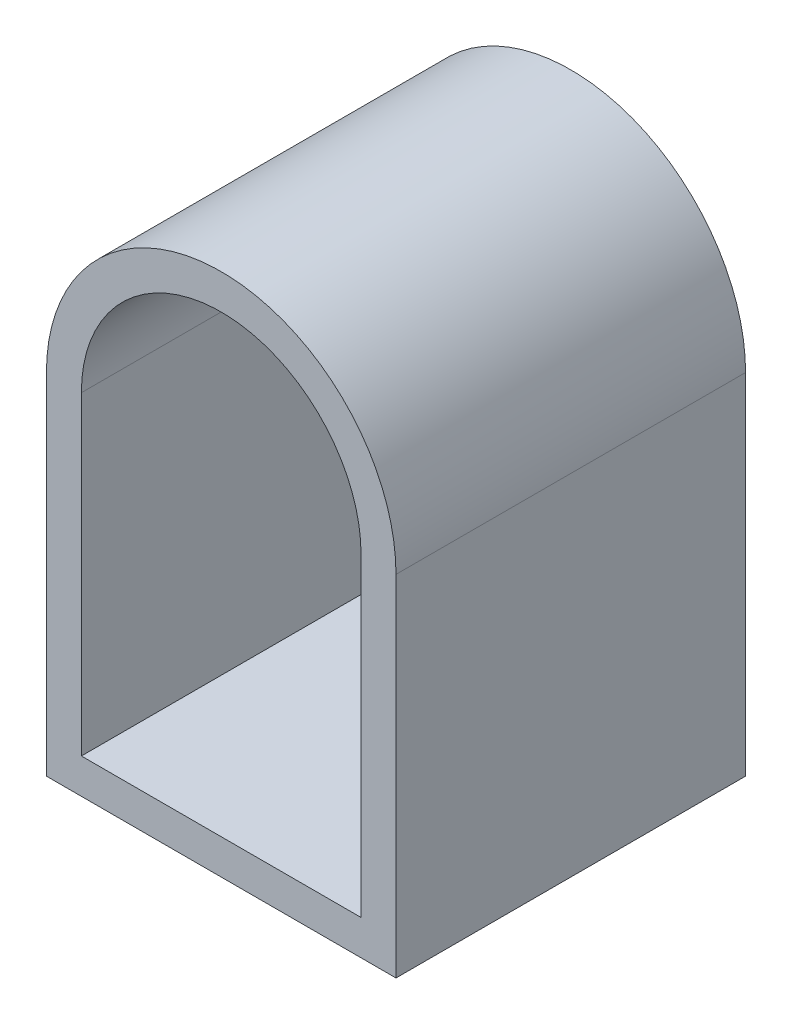
ISO-10303-21;
HEADER;
FILE_DESCRIPTION(('STEP AP214'),'2;1');
FILE_NAME('part.step','',(''),(''),'','','');
FILE_SCHEMA(('AUTOMOTIVE_DESIGN { 1 0 10303 214 1 1 1 1 }'));
ENDSEC;
DATA;
#1=APPLICATION_CONTEXT('core data for automotive mechanical design processes');
#2=APPLICATION_PROTOCOL_DEFINITION('international standard','automotive_design',2000,#1);
#3=PRODUCT_CONTEXT('',#1,'mechanical');
#4=PRODUCT('Part','Part','',(#3));
#5=PRODUCT_RELATED_PRODUCT_CATEGORY('part','',(#4));
#6=PRODUCT_DEFINITION_FORMATION('','',#4);
#7=PRODUCT_DEFINITION_CONTEXT('part definition',#1,'design');
#8=PRODUCT_DEFINITION('design','',#6,#7);
#9=PRODUCT_DEFINITION_SHAPE('','',#8);
#10=(LENGTH_UNIT() NAMED_UNIT(*) SI_UNIT(.MILLI.,.METRE.));
#11=(NAMED_UNIT(*) PLANE_ANGLE_UNIT() SI_UNIT($,.RADIAN.));
#12=(NAMED_UNIT(*) SI_UNIT($,.STERADIAN.) SOLID_ANGLE_UNIT());
#13=UNCERTAINTY_MEASURE_WITH_UNIT(LENGTH_MEASURE(1.E-05),#10,'distance_accuracy_value','');
#14=(GEOMETRIC_REPRESENTATION_CONTEXT(3) GLOBAL_UNCERTAINTY_ASSIGNED_CONTEXT((#13)) GLOBAL_UNIT_ASSIGNED_CONTEXT((#10,
#11,#12)) REPRESENTATION_CONTEXT('',''));
#15=CARTESIAN_POINT('',(0.,0.,0.));
#16=DIRECTION('',(0.,0.,1.));
#17=DIRECTION('',(1.,0.,0.));
#18=AXIS2_PLACEMENT_3D('',#15,#16,#17);
#19=CARTESIAN_POINT('',(6.35,12.7,12.7));
#20=DIRECTION('',(0.,0.,-1.));
#21=DIRECTION('',(-1.,0.,0.));
#22=AXIS2_PLACEMENT_3D('',#19,#20,#21);
#23=PLANE('',#22);
#24=DIRECTION('',(1.,0.,0.));
#25=VECTOR('',#24,1.);
#26=CARTESIAN_POINT('',(12.7,0.,12.7));
#27=LINE('',#26,#25);
#28=CARTESIAN_POINT('',(0.,0.,12.7));
#29=VERTEX_POINT('',#28);
#30=CARTESIAN_POINT('',(12.7,0.,12.7));
#31=VERTEX_POINT('',#30);
#32=EDGE_CURVE('E153',#29,#31,#27,.T.);
#33=ORIENTED_EDGE('',*,*,#32,.T.);
#34=DIRECTION('',(0.,1.,0.));
#35=VECTOR('',#34,1.);
#36=CARTESIAN_POINT('',(12.7,12.7,12.7));
#37=LINE('',#36,#35);
#38=CARTESIAN_POINT('',(12.7,12.7,12.7));
#39=VERTEX_POINT('',#38);
#40=EDGE_CURVE('E157',#31,#39,#37,.T.);
#41=ORIENTED_EDGE('',*,*,#40,.T.);
#42=CARTESIAN_POINT('',(6.35,12.7,12.7));
#43=DIRECTION('',(0.,0.,1.));
#44=DIRECTION('',(-1.,0.,0.));
#45=AXIS2_PLACEMENT_3D('',#42,#43,#44);
#46=CIRCLE('',#45,6.35);
#47=CARTESIAN_POINT('',(0.,12.7,12.7));
#48=VERTEX_POINT('',#47);
#49=EDGE_CURVE('E161',#39,#48,#46,.T.);
#50=ORIENTED_EDGE('',*,*,#49,.T.);
#51=DIRECTION('',(0.,-1.,0.));
#52=VECTOR('',#51,1.);
#53=CARTESIAN_POINT('',(0.,0.,12.7));
#54=LINE('',#53,#52);
#55=EDGE_CURVE('E164',#48,#29,#54,.T.);
#56=ORIENTED_EDGE('',*,*,#55,.T.);
#57=EDGE_LOOP('',(#33,#41,#50,#56));
#58=FACE_BOUND('',#57,.T.);
#59=DIRECTION('',(0.,-1.,0.));
#60=VECTOR('',#59,1.);
#61=CARTESIAN_POINT('',(1.27,12.7,12.7));
#62=LINE('',#61,#60);
#63=CARTESIAN_POINT('',(1.27,12.7,12.7));
#64=VERTEX_POINT('',#63);
#65=CARTESIAN_POINT('',(1.27,1.27,12.7));
#66=VERTEX_POINT('',#65);
#67=EDGE_CURVE('E105',#64,#66,#62,.T.);
#68=ORIENTED_EDGE('',*,*,#67,.F.);
#69=CARTESIAN_POINT('',(6.35,12.7,12.7));
#70=DIRECTION('',(0.,0.,1.));
#71=DIRECTION('',(1.,0.,0.));
#72=AXIS2_PLACEMENT_3D('',#69,#70,#71);
#73=CIRCLE('',#72,5.08);
#74=CARTESIAN_POINT('',(11.43,12.7,12.7));
#75=VERTEX_POINT('',#74);
#76=EDGE_CURVE('E131',#75,#64,#73,.T.);
#77=ORIENTED_EDGE('',*,*,#76,.F.);
#78=DIRECTION('',(0.,1.,0.));
#79=VECTOR('',#78,1.);
#80=CARTESIAN_POINT('',(11.43,1.27,12.7));
#81=LINE('',#80,#79);
#82=CARTESIAN_POINT('',(11.43,1.27,12.7));
#83=VERTEX_POINT('',#82);
#84=EDGE_CURVE('E127',#83,#75,#81,.T.);
#85=ORIENTED_EDGE('',*,*,#84,.F.);
#86=DIRECTION('',(1.,0.,0.));
#87=VECTOR('',#86,1.);
#88=CARTESIAN_POINT('',(1.27,1.27,12.7));
#89=LINE('',#88,#87);
#90=EDGE_CURVE('E114',#66,#83,#89,.T.);
#91=ORIENTED_EDGE('',*,*,#90,.F.);
#92=EDGE_LOOP('',(#68,#77,#85,#91));
#93=FACE_BOUND('',#92,.T.);
#94=ADVANCED_FACE('F39',(#58,#93),#23,.F.);
#95=CARTESIAN_POINT('',(6.35,12.7,0.));
#96=DIRECTION('',(0.,0.,-1.));
#97=DIRECTION('',(-1.,0.,0.));
#98=AXIS2_PLACEMENT_3D('',#95,#96,#97);
#99=PLANE('',#98);
#100=DIRECTION('',(1.,0.,0.));
#101=VECTOR('',#100,1.);
#102=CARTESIAN_POINT('',(12.7,0.,0.));
#103=LINE('',#102,#101);
#104=CARTESIAN_POINT('',(0.,0.,0.));
#105=VERTEX_POINT('',#104);
#106=CARTESIAN_POINT('',(12.7,0.,0.));
#107=VERTEX_POINT('',#106);
#108=EDGE_CURVE('E123',#105,#107,#103,.T.);
#109=ORIENTED_EDGE('',*,*,#108,.F.);
#110=DIRECTION('',(0.,-1.,0.));
#111=VECTOR('',#110,1.);
#112=CARTESIAN_POINT('',(0.,0.,0.));
#113=LINE('',#112,#111);
#114=CARTESIAN_POINT('',(0.,12.7,0.));
#115=VERTEX_POINT('',#114);
#116=EDGE_CURVE('E158',#115,#105,#113,.T.);
#117=ORIENTED_EDGE('',*,*,#116,.F.);
#118=CARTESIAN_POINT('',(6.35,12.7,0.));
#119=DIRECTION('',(0.,0.,1.));
#120=DIRECTION('',(-1.,0.,0.));
#121=AXIS2_PLACEMENT_3D('',#118,#119,#120);
#122=CIRCLE('',#121,6.35);
#123=CARTESIAN_POINT('',(12.7,12.7,0.));
#124=VERTEX_POINT('',#123);
#125=EDGE_CURVE('E174',#124,#115,#122,.T.);
#126=ORIENTED_EDGE('',*,*,#125,.F.);
#127=DIRECTION('',(0.,1.,0.));
#128=VECTOR('',#127,1.);
#129=CARTESIAN_POINT('',(12.7,12.7,0.));
#130=LINE('',#129,#128);
#131=EDGE_CURVE('E171',#107,#124,#130,.T.);
#132=ORIENTED_EDGE('',*,*,#131,.F.);
#133=EDGE_LOOP('',(#109,#117,#126,#132));
#134=FACE_BOUND('',#133,.T.);
#135=CARTESIAN_POINT('',(6.35,12.7,0.));
#136=DIRECTION('',(0.,0.,1.));
#137=DIRECTION('',(1.,0.,0.));
#138=AXIS2_PLACEMENT_3D('',#135,#136,#137);
#139=CIRCLE('',#138,5.08);
#140=CARTESIAN_POINT('',(11.43,12.7,0.));
#141=VERTEX_POINT('',#140);
#142=CARTESIAN_POINT('',(1.27,12.7,0.));
#143=VERTEX_POINT('',#142);
#144=EDGE_CURVE('E115',#141,#143,#139,.T.);
#145=ORIENTED_EDGE('',*,*,#144,.T.);
#146=DIRECTION('',(0.,-1.,0.));
#147=VECTOR('',#146,1.);
#148=CARTESIAN_POINT('',(1.27,12.7,0.));
#149=LINE('',#148,#147);
#150=CARTESIAN_POINT('',(1.27,1.27,0.));
#151=VERTEX_POINT('',#150);
#152=EDGE_CURVE('E63',#143,#151,#149,.T.);
#153=ORIENTED_EDGE('',*,*,#152,.T.);
#154=DIRECTION('',(1.,0.,0.));
#155=VECTOR('',#154,1.);
#156=CARTESIAN_POINT('',(1.27,1.27,0.));
#157=LINE('',#156,#155);
#158=CARTESIAN_POINT('',(11.43,1.27,0.));
#159=VERTEX_POINT('',#158);
#160=EDGE_CURVE('E121',#151,#159,#157,.T.);
#161=ORIENTED_EDGE('',*,*,#160,.T.);
#162=DIRECTION('',(0.,1.,0.));
#163=VECTOR('',#162,1.);
#164=CARTESIAN_POINT('',(11.43,1.27,0.));
#165=LINE('',#164,#163);
#166=EDGE_CURVE('E140',#159,#141,#165,.T.);
#167=ORIENTED_EDGE('',*,*,#166,.T.);
#168=EDGE_LOOP('',(#145,#153,#161,#167));
#169=FACE_BOUND('',#168,.T.);
#170=ADVANCED_FACE('F197',(#134,#169),#99,.T.);
#171=CARTESIAN_POINT('',(12.7,0.,12.7));
#172=DIRECTION('',(0.,1.,0.));
#173=DIRECTION('',(-1.,0.,0.));
#174=AXIS2_PLACEMENT_3D('',#171,#172,#173);
#175=PLANE('',#174);
#176=ORIENTED_EDGE('',*,*,#108,.T.);
#177=DIRECTION('',(0.,0.,-1.));
#178=VECTOR('',#177,1.);
#179=CARTESIAN_POINT('',(12.7,0.,12.7));
#180=LINE('',#179,#178);
#181=EDGE_CURVE('E11',#31,#107,#180,.T.);
#182=ORIENTED_EDGE('',*,*,#181,.F.);
#183=ORIENTED_EDGE('',*,*,#32,.F.);
#184=DIRECTION('',(0.,0.,-1.));
#185=VECTOR('',#184,1.);
#186=CARTESIAN_POINT('',(0.,0.,12.7));
#187=LINE('',#186,#185);
#188=EDGE_CURVE('E167',#29,#105,#187,.T.);
#189=ORIENTED_EDGE('',*,*,#188,.T.);
#190=EDGE_LOOP('',(#176,#182,#183,#189));
#191=FACE_BOUND('',#190,.T.);
#192=ADVANCED_FACE('F41',(#191),#175,.F.);
#193=CARTESIAN_POINT('',(12.7,12.7,12.7));
#194=DIRECTION('',(-1.,0.,0.));
#195=DIRECTION('',(0.,-1.,0.));
#196=AXIS2_PLACEMENT_3D('',#193,#194,#195);
#197=PLANE('',#196);
#198=ORIENTED_EDGE('',*,*,#131,.T.);
#199=DIRECTION('',(0.,0.,-1.));
#200=VECTOR('',#199,1.);
#201=CARTESIAN_POINT('',(12.7,12.7,12.7));
#202=LINE('',#201,#200);
#203=EDGE_CURVE('E48',#39,#124,#202,.T.);
#204=ORIENTED_EDGE('',*,*,#203,.F.);
#205=ORIENTED_EDGE('',*,*,#40,.F.);
#206=ORIENTED_EDGE('',*,*,#181,.T.);
#207=EDGE_LOOP('',(#198,#204,#205,#206));
#208=FACE_BOUND('',#207,.T.);
#209=ADVANCED_FACE('F207',(#208),#197,.F.);
#210=CARTESIAN_POINT('',(6.35,12.7,12.7));
#211=DIRECTION('',(0.,0.,-1.));
#212=DIRECTION('',(-1.,0.,0.));
#213=AXIS2_PLACEMENT_3D('',#210,#211,#212);
#214=CYLINDRICAL_SURFACE('',#213,6.35);
#215=ORIENTED_EDGE('',*,*,#125,.T.);
#216=DIRECTION('',(0.,0.,-1.));
#217=VECTOR('',#216,1.);
#218=CARTESIAN_POINT('',(0.,12.7,12.7));
#219=LINE('',#218,#217);
#220=EDGE_CURVE('E182',#48,#115,#219,.T.);
#221=ORIENTED_EDGE('',*,*,#220,.F.);
#222=ORIENTED_EDGE('',*,*,#49,.F.);
#223=ORIENTED_EDGE('',*,*,#203,.T.);
#224=EDGE_LOOP('',(#215,#221,#222,#223));
#225=FACE_BOUND('',#224,.T.);
#226=ADVANCED_FACE('F191',(#225),#214,.T.);
#227=CARTESIAN_POINT('',(0.,0.,12.7));
#228=DIRECTION('',(1.,0.,0.));
#229=DIRECTION('',(0.,0.,-1.));
#230=AXIS2_PLACEMENT_3D('',#227,#228,#229);
#231=PLANE('',#230);
#232=ORIENTED_EDGE('',*,*,#116,.T.);
#233=ORIENTED_EDGE('',*,*,#188,.F.);
#234=ORIENTED_EDGE('',*,*,#55,.F.);
#235=ORIENTED_EDGE('',*,*,#220,.T.);
#236=EDGE_LOOP('',(#232,#233,#234,#235));
#237=FACE_BOUND('',#236,.T.);
#238=ADVANCED_FACE('F201',(#237),#231,.F.);
#239=CARTESIAN_POINT('',(1.27,12.7,12.7));
#240=DIRECTION('',(1.,0.,0.));
#241=DIRECTION('',(0.,1.,0.));
#242=AXIS2_PLACEMENT_3D('',#239,#240,#241);
#243=PLANE('',#242);
#244=ORIENTED_EDGE('',*,*,#152,.F.);
#245=DIRECTION('',(0.,0.,-1.));
#246=VECTOR('',#245,1.);
#247=CARTESIAN_POINT('',(1.27,12.7,12.7));
#248=LINE('',#247,#246);
#249=EDGE_CURVE('E109',#64,#143,#248,.T.);
#250=ORIENTED_EDGE('',*,*,#249,.F.);
#251=ORIENTED_EDGE('',*,*,#67,.T.);
#252=DIRECTION('',(0.,0.,-1.));
#253=VECTOR('',#252,1.);
#254=CARTESIAN_POINT('',(1.27,1.27,12.7));
#255=LINE('',#254,#253);
#256=EDGE_CURVE('E108',#66,#151,#255,.T.);
#257=ORIENTED_EDGE('',*,*,#256,.T.);
#258=EDGE_LOOP('',(#244,#250,#251,#257));
#259=FACE_BOUND('',#258,.T.);
#260=ADVANCED_FACE('F107',(#259),#243,.T.);
#261=CARTESIAN_POINT('',(1.27,1.27,12.7));
#262=DIRECTION('',(0.,1.,0.));
#263=DIRECTION('',(0.,0.,1.));
#264=AXIS2_PLACEMENT_3D('',#261,#262,#263);
#265=PLANE('',#264);
#266=ORIENTED_EDGE('',*,*,#160,.F.);
#267=ORIENTED_EDGE('',*,*,#256,.F.);
#268=ORIENTED_EDGE('',*,*,#90,.T.);
#269=DIRECTION('',(0.,0.,-1.));
#270=VECTOR('',#269,1.);
#271=CARTESIAN_POINT('',(11.43,1.27,12.7));
#272=LINE('',#271,#270);
#273=EDGE_CURVE('E124',#83,#159,#272,.T.);
#274=ORIENTED_EDGE('',*,*,#273,.T.);
#275=EDGE_LOOP('',(#266,#267,#268,#274));
#276=FACE_BOUND('',#275,.T.);
#277=ADVANCED_FACE('F118',(#276),#265,.T.);
#278=CARTESIAN_POINT('',(11.43,1.27,12.7));
#279=DIRECTION('',(-1.,0.,0.));
#280=DIRECTION('',(0.,0.,1.));
#281=AXIS2_PLACEMENT_3D('',#278,#279,#280);
#282=PLANE('',#281);
#283=ORIENTED_EDGE('',*,*,#166,.F.);
#284=ORIENTED_EDGE('',*,*,#273,.F.);
#285=ORIENTED_EDGE('',*,*,#84,.T.);
#286=DIRECTION('',(0.,0.,-1.));
#287=VECTOR('',#286,1.);
#288=CARTESIAN_POINT('',(11.43,12.7,12.7));
#289=LINE('',#288,#287);
#290=EDGE_CURVE('E55',#75,#141,#289,.T.);
#291=ORIENTED_EDGE('',*,*,#290,.T.);
#292=EDGE_LOOP('',(#283,#284,#285,#291));
#293=FACE_BOUND('',#292,.T.);
#294=ADVANCED_FACE('F230',(#293),#282,.T.);
#295=CARTESIAN_POINT('',(6.35,12.7,12.7));
#296=DIRECTION('',(0.,0.,-1.));
#297=DIRECTION('',(-1.,0.,0.));
#298=AXIS2_PLACEMENT_3D('',#295,#296,#297);
#299=CYLINDRICAL_SURFACE('',#298,5.08);
#300=ORIENTED_EDGE('',*,*,#144,.F.);
#301=ORIENTED_EDGE('',*,*,#290,.F.);
#302=ORIENTED_EDGE('',*,*,#76,.T.);
#303=ORIENTED_EDGE('',*,*,#249,.T.);
#304=EDGE_LOOP('',(#300,#301,#302,#303));
#305=FACE_BOUND('',#304,.T.);
#306=ADVANCED_FACE('F234',(#305),#299,.F.);
#307=CLOSED_SHELL('',(#94,#170,#192,#209,#226,#238,#260,#277,#294,#306));
#308=MANIFOLD_SOLID_BREP('B2',#307);
#309=ADVANCED_BREP_SHAPE_REPRESENTATION('',(#18,#308),#14);
#310=SHAPE_DEFINITION_REPRESENTATION(#9,#309);
ENDSEC;
END-ISO-10303-21;
